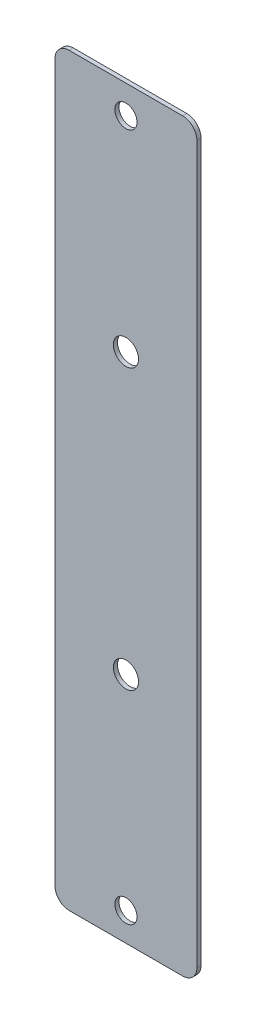
ISO-10303-21;
HEADER;
FILE_DESCRIPTION(('STEP AP214'),'2;1');
FILE_NAME('part.step','',(''),(''),'','','');
FILE_SCHEMA(('AUTOMOTIVE_DESIGN { 1 0 10303 214 1 1 1 1 }'));
ENDSEC;
DATA;
#1=APPLICATION_CONTEXT('core data for automotive mechanical design processes');
#2=APPLICATION_PROTOCOL_DEFINITION('international standard','automotive_design',2000,#1);
#3=PRODUCT_CONTEXT('',#1,'mechanical');
#4=PRODUCT('Part','Part','',(#3));
#5=PRODUCT_RELATED_PRODUCT_CATEGORY('part','',(#4));
#6=PRODUCT_DEFINITION_FORMATION('','',#4);
#7=PRODUCT_DEFINITION_CONTEXT('part definition',#1,'design');
#8=PRODUCT_DEFINITION('design','',#6,#7);
#9=PRODUCT_DEFINITION_SHAPE('','',#8);
#10=(LENGTH_UNIT() NAMED_UNIT(*) SI_UNIT(.MILLI.,.METRE.));
#11=(NAMED_UNIT(*) PLANE_ANGLE_UNIT() SI_UNIT($,.RADIAN.));
#12=(NAMED_UNIT(*) SI_UNIT($,.STERADIAN.) SOLID_ANGLE_UNIT());
#13=UNCERTAINTY_MEASURE_WITH_UNIT(LENGTH_MEASURE(1.E-05),#10,'distance_accuracy_value','');
#14=(GEOMETRIC_REPRESENTATION_CONTEXT(3) GLOBAL_UNCERTAINTY_ASSIGNED_CONTEXT((#13)) GLOBAL_UNIT_ASSIGNED_CONTEXT((#10,
#11,#12)) REPRESENTATION_CONTEXT('',''));
#15=CARTESIAN_POINT('',(0.,0.,0.));
#16=DIRECTION('',(0.,0.,1.));
#17=DIRECTION('',(1.,0.,0.));
#18=AXIS2_PLACEMENT_3D('',#15,#16,#17);
#19=CARTESIAN_POINT('',(0.,0.,-0.7366));
#20=DIRECTION('',(-1.,0.,0.));
#21=DIRECTION('',(0.,0.,1.));
#22=AXIS2_PLACEMENT_3D('',#19,#20,#21);
#23=PLANE('',#22);
#24=DIRECTION('',(0.,-1.,0.));
#25=VECTOR('',#24,1.);
#26=CARTESIAN_POINT('',(0.,0.,-0.7366));
#27=LINE('',#26,#25);
#28=CARTESIAN_POINT('',(0.,130.81,-0.7366));
#29=VERTEX_POINT('',#28);
#30=CARTESIAN_POINT('',(0.,2.54,-0.7366));
#31=VERTEX_POINT('',#30);
#32=EDGE_CURVE('E164',#29,#31,#27,.T.);
#33=ORIENTED_EDGE('',*,*,#32,.T.);
#34=DIRECTION('',(0.,0.,1.));
#35=VECTOR('',#34,1.);
#36=CARTESIAN_POINT('',(0.,2.54,-0.7366));
#37=LINE('',#36,#35);
#38=CARTESIAN_POINT('',(0.,2.54,0.));
#39=VERTEX_POINT('',#38);
#40=EDGE_CURVE('E111',#31,#39,#37,.T.);
#41=ORIENTED_EDGE('',*,*,#40,.T.);
#42=DIRECTION('',(0.,-1.,0.));
#43=VECTOR('',#42,1.);
#44=CARTESIAN_POINT('',(0.,0.,0.));
#45=LINE('',#44,#43);
#46=CARTESIAN_POINT('',(0.,130.81,0.));
#47=VERTEX_POINT('',#46);
#48=EDGE_CURVE('E103',#47,#39,#45,.T.);
#49=ORIENTED_EDGE('',*,*,#48,.F.);
#50=DIRECTION('',(0.,0.,1.));
#51=VECTOR('',#50,1.);
#52=CARTESIAN_POINT('',(0.,130.81,-0.7366));
#53=LINE('',#52,#51);
#54=EDGE_CURVE('E116',#47,#29,#53,.F.);
#55=ORIENTED_EDGE('',*,*,#54,.T.);
#56=EDGE_LOOP('',(#33,#41,#49,#55));
#57=FACE_BOUND('',#56,.T.);
#58=ADVANCED_FACE('F34',(#57),#23,.T.);
#59=CARTESIAN_POINT('',(0.,133.35,-0.7366));
#60=DIRECTION('',(0.,1.,0.));
#61=DIRECTION('',(0.,0.,1.));
#62=AXIS2_PLACEMENT_3D('',#59,#60,#61);
#63=PLANE('',#62);
#64=DIRECTION('',(-1.,0.,0.));
#65=VECTOR('',#64,1.);
#66=CARTESIAN_POINT('',(0.,133.35,0.));
#67=LINE('',#66,#65);
#68=CARTESIAN_POINT('',(22.86,133.35,0.));
#69=VERTEX_POINT('',#68);
#70=CARTESIAN_POINT('',(2.54,133.35,0.));
#71=VERTEX_POINT('',#70);
#72=EDGE_CURVE('E105',#69,#71,#67,.T.);
#73=ORIENTED_EDGE('',*,*,#72,.F.);
#74=DIRECTION('',(0.,0.,1.));
#75=VECTOR('',#74,1.);
#76=CARTESIAN_POINT('',(22.86,133.35,-0.7366));
#77=LINE('',#76,#75);
#78=CARTESIAN_POINT('',(22.86,133.35,-0.7366));
#79=VERTEX_POINT('',#78);
#80=EDGE_CURVE('E11',#69,#79,#77,.F.);
#81=ORIENTED_EDGE('',*,*,#80,.T.);
#82=DIRECTION('',(-1.,0.,0.));
#83=VECTOR('',#82,1.);
#84=CARTESIAN_POINT('',(0.,133.35,-0.7366));
#85=LINE('',#84,#83);
#86=CARTESIAN_POINT('',(2.54,133.35,-0.7366));
#87=VERTEX_POINT('',#86);
#88=EDGE_CURVE('E124',#79,#87,#85,.T.);
#89=ORIENTED_EDGE('',*,*,#88,.T.);
#90=DIRECTION('',(0.,0.,1.));
#91=VECTOR('',#90,1.);
#92=CARTESIAN_POINT('',(2.54,133.35,-0.7366));
#93=LINE('',#92,#91);
#94=EDGE_CURVE('E42',#87,#71,#93,.T.);
#95=ORIENTED_EDGE('',*,*,#94,.T.);
#96=EDGE_LOOP('',(#73,#81,#89,#95));
#97=FACE_BOUND('',#96,.T.);
#98=ADVANCED_FACE('F153',(#97),#63,.T.);
#99=CARTESIAN_POINT('',(25.4,0.,-0.7366));
#100=DIRECTION('',(1.,0.,0.));
#101=DIRECTION('',(0.,1.,0.));
#102=AXIS2_PLACEMENT_3D('',#99,#100,#101);
#103=PLANE('',#102);
#104=DIRECTION('',(0.,1.,0.));
#105=VECTOR('',#104,1.);
#106=CARTESIAN_POINT('',(25.4,0.,0.));
#107=LINE('',#106,#105);
#108=CARTESIAN_POINT('',(25.4,2.54,0.));
#109=VERTEX_POINT('',#108);
#110=CARTESIAN_POINT('',(25.4,130.81,0.));
#111=VERTEX_POINT('',#110);
#112=EDGE_CURVE('E162',#109,#111,#107,.T.);
#113=ORIENTED_EDGE('',*,*,#112,.F.);
#114=DIRECTION('',(0.,0.,1.));
#115=VECTOR('',#114,1.);
#116=CARTESIAN_POINT('',(25.4,2.54,-0.7366));
#117=LINE('',#116,#115);
#118=CARTESIAN_POINT('',(25.4,2.54,-0.7366));
#119=VERTEX_POINT('',#118);
#120=EDGE_CURVE('E56',#109,#119,#117,.F.);
#121=ORIENTED_EDGE('',*,*,#120,.T.);
#122=DIRECTION('',(0.,1.,0.));
#123=VECTOR('',#122,1.);
#124=CARTESIAN_POINT('',(25.4,0.,-0.7366));
#125=LINE('',#124,#123);
#126=CARTESIAN_POINT('',(25.4,130.81,-0.7366));
#127=VERTEX_POINT('',#126);
#128=EDGE_CURVE('E128',#119,#127,#125,.T.);
#129=ORIENTED_EDGE('',*,*,#128,.T.);
#130=DIRECTION('',(0.,0.,1.));
#131=VECTOR('',#130,1.);
#132=CARTESIAN_POINT('',(25.4,130.81,-0.7366));
#133=LINE('',#132,#131);
#134=EDGE_CURVE('E149',#127,#111,#133,.T.);
#135=ORIENTED_EDGE('',*,*,#134,.T.);
#136=EDGE_LOOP('',(#113,#121,#129,#135));
#137=FACE_BOUND('',#136,.T.);
#138=ADVANCED_FACE('F161',(#137),#103,.T.);
#139=CARTESIAN_POINT('',(0.,0.,-0.7366));
#140=DIRECTION('',(0.,-1.,0.));
#141=DIRECTION('',(0.,0.,-1.));
#142=AXIS2_PLACEMENT_3D('',#139,#140,#141);
#143=PLANE('',#142);
#144=DIRECTION('',(1.,0.,0.));
#145=VECTOR('',#144,1.);
#146=CARTESIAN_POINT('',(0.,0.,0.));
#147=LINE('',#146,#145);
#148=CARTESIAN_POINT('',(2.54,0.,0.));
#149=VERTEX_POINT('',#148);
#150=CARTESIAN_POINT('',(22.86,0.,0.));
#151=VERTEX_POINT('',#150);
#152=EDGE_CURVE('E119',#149,#151,#147,.T.);
#153=ORIENTED_EDGE('',*,*,#152,.F.);
#154=DIRECTION('',(0.,0.,1.));
#155=VECTOR('',#154,1.);
#156=CARTESIAN_POINT('',(2.54,0.,-0.7366));
#157=LINE('',#156,#155);
#158=CARTESIAN_POINT('',(2.54,0.,-0.7366));
#159=VERTEX_POINT('',#158);
#160=EDGE_CURVE('E141',#149,#159,#157,.F.);
#161=ORIENTED_EDGE('',*,*,#160,.T.);
#162=DIRECTION('',(1.,0.,0.));
#163=VECTOR('',#162,1.);
#164=CARTESIAN_POINT('',(0.,0.,-0.7366));
#165=LINE('',#164,#163);
#166=CARTESIAN_POINT('',(22.86,0.,-0.7366));
#167=VERTEX_POINT('',#166);
#168=EDGE_CURVE('E168',#159,#167,#165,.T.);
#169=ORIENTED_EDGE('',*,*,#168,.T.);
#170=DIRECTION('',(0.,0.,1.));
#171=VECTOR('',#170,1.);
#172=CARTESIAN_POINT('',(22.86,0.,-0.7366));
#173=LINE('',#172,#171);
#174=EDGE_CURVE('E138',#167,#151,#173,.T.);
#175=ORIENTED_EDGE('',*,*,#174,.T.);
#176=EDGE_LOOP('',(#153,#161,#169,#175));
#177=FACE_BOUND('',#176,.T.);
#178=ADVANCED_FACE('F230',(#177),#143,.T.);
#179=CARTESIAN_POINT('',(0.,0.,-0.7366));
#180=DIRECTION('',(0.,0.,-1.));
#181=DIRECTION('',(-1.,0.,0.));
#182=AXIS2_PLACEMENT_3D('',#179,#180,#181);
#183=PLANE('',#182);
#184=CARTESIAN_POINT('',(12.7,5.08,-0.7366));
#185=DIRECTION('',(0.,0.,1.));
#186=DIRECTION('',(1.,0.,0.));
#187=AXIS2_PLACEMENT_3D('',#184,#185,#186);
#188=CIRCLE('',#187,1.984375);
#189=CARTESIAN_POINT('',(14.684375,5.08,-0.7366));
#190=VERTEX_POINT('',#189);
#191=EDGE_CURVE('E189',#190,#190,#188,.T.);
#192=ORIENTED_EDGE('',*,*,#191,.T.);
#193=EDGE_LOOP('',(#192));
#194=FACE_BOUND('',#193,.T.);
#195=CARTESIAN_POINT('',(12.7,128.27,-0.7366));
#196=DIRECTION('',(0.,0.,1.));
#197=DIRECTION('',(1.,0.,0.));
#198=AXIS2_PLACEMENT_3D('',#195,#196,#197);
#199=CIRCLE('',#198,1.984375);
#200=CARTESIAN_POINT('',(14.684375,128.27,-0.7366));
#201=VERTEX_POINT('',#200);
#202=EDGE_CURVE('E183',#201,#201,#199,.T.);
#203=ORIENTED_EDGE('',*,*,#202,.T.);
#204=EDGE_LOOP('',(#203));
#205=FACE_BOUND('',#204,.T.);
#206=CARTESIAN_POINT('',(12.7,91.675,-0.7366));
#207=DIRECTION('',(0.,0.,1.));
#208=DIRECTION('',(1.,0.,0.));
#209=AXIS2_PLACEMENT_3D('',#206,#207,#208);
#210=CIRCLE('',#209,2.25);
#211=CARTESIAN_POINT('',(14.95,91.675,-0.7366));
#212=VERTEX_POINT('',#211);
#213=EDGE_CURVE('E177',#212,#212,#210,.T.);
#214=ORIENTED_EDGE('',*,*,#213,.T.);
#215=EDGE_LOOP('',(#214));
#216=FACE_BOUND('',#215,.T.);
#217=CARTESIAN_POINT('',(12.7,41.675,-0.7366));
#218=DIRECTION('',(0.,0.,1.));
#219=DIRECTION('',(1.,0.,0.));
#220=AXIS2_PLACEMENT_3D('',#217,#218,#219);
#221=CIRCLE('',#220,2.25);
#222=CARTESIAN_POINT('',(14.95,41.675,-0.7366));
#223=VERTEX_POINT('',#222);
#224=EDGE_CURVE('E120',#223,#223,#221,.T.);
#225=ORIENTED_EDGE('',*,*,#224,.T.);
#226=EDGE_LOOP('',(#225));
#227=FACE_BOUND('',#226,.T.);
#228=ORIENTED_EDGE('',*,*,#168,.F.);
#229=CARTESIAN_POINT('',(2.54,2.54,-0.7366));
#230=DIRECTION('',(0.,0.,-1.));
#231=DIRECTION('',(-1.,0.,0.));
#232=AXIS2_PLACEMENT_3D('',#229,#230,#231);
#233=CIRCLE('',#232,2.54);
#234=EDGE_CURVE('E147',#159,#31,#233,.T.);
#235=ORIENTED_EDGE('',*,*,#234,.T.);
#236=ORIENTED_EDGE('',*,*,#32,.F.);
#237=CARTESIAN_POINT('',(2.54,130.81,-0.7366));
#238=DIRECTION('',(0.,0.,-1.));
#239=DIRECTION('',(-1.,0.,0.));
#240=AXIS2_PLACEMENT_3D('',#237,#238,#239);
#241=CIRCLE('',#240,2.54);
#242=EDGE_CURVE('E123',#29,#87,#241,.T.);
#243=ORIENTED_EDGE('',*,*,#242,.T.);
#244=ORIENTED_EDGE('',*,*,#88,.F.);
#245=CARTESIAN_POINT('',(22.86,130.81,-0.7366));
#246=DIRECTION('',(0.,0.,-1.));
#247=DIRECTION('',(-1.,0.,0.));
#248=AXIS2_PLACEMENT_3D('',#245,#246,#247);
#249=CIRCLE('',#248,2.54);
#250=EDGE_CURVE('E49',#79,#127,#249,.T.);
#251=ORIENTED_EDGE('',*,*,#250,.T.);
#252=ORIENTED_EDGE('',*,*,#128,.F.);
#253=CARTESIAN_POINT('',(22.86,2.54,-0.7366));
#254=DIRECTION('',(0.,0.,-1.));
#255=DIRECTION('',(-1.,0.,0.));
#256=AXIS2_PLACEMENT_3D('',#253,#254,#255);
#257=CIRCLE('',#256,2.54);
#258=EDGE_CURVE('E145',#119,#167,#257,.T.);
#259=ORIENTED_EDGE('',*,*,#258,.T.);
#260=EDGE_LOOP('',(#228,#235,#236,#243,#244,#251,#252,#259));
#261=FACE_BOUND('',#260,.T.);
#262=ADVANCED_FACE('F156',(#194,#205,#216,#227,#261),#183,.T.);
#263=CARTESIAN_POINT('',(0.,0.,0.));
#264=DIRECTION('',(0.,0.,-1.));
#265=DIRECTION('',(-1.,0.,0.));
#266=AXIS2_PLACEMENT_3D('',#263,#264,#265);
#267=PLANE('',#266);
#268=CARTESIAN_POINT('',(12.7,5.08,0.));
#269=DIRECTION('',(0.,0.,1.));
#270=DIRECTION('',(1.,0.,0.));
#271=AXIS2_PLACEMENT_3D('',#268,#269,#270);
#272=CIRCLE('',#271,1.984375);
#273=CARTESIAN_POINT('',(14.684375,5.08,0.));
#274=VERTEX_POINT('',#273);
#275=EDGE_CURVE('E192',#274,#274,#272,.T.);
#276=ORIENTED_EDGE('',*,*,#275,.F.);
#277=EDGE_LOOP('',(#276));
#278=FACE_BOUND('',#277,.T.);
#279=CARTESIAN_POINT('',(12.7,128.27,0.));
#280=DIRECTION('',(0.,0.,1.));
#281=DIRECTION('',(1.,0.,0.));
#282=AXIS2_PLACEMENT_3D('',#279,#280,#281);
#283=CIRCLE('',#282,1.984375);
#284=CARTESIAN_POINT('',(14.684375,128.27,0.));
#285=VERTEX_POINT('',#284);
#286=EDGE_CURVE('E186',#285,#285,#283,.T.);
#287=ORIENTED_EDGE('',*,*,#286,.F.);
#288=EDGE_LOOP('',(#287));
#289=FACE_BOUND('',#288,.T.);
#290=CARTESIAN_POINT('',(12.7,91.675,0.));
#291=DIRECTION('',(0.,0.,1.));
#292=DIRECTION('',(1.,0.,0.));
#293=AXIS2_PLACEMENT_3D('',#290,#291,#292);
#294=CIRCLE('',#293,2.25);
#295=CARTESIAN_POINT('',(14.95,91.675,0.));
#296=VERTEX_POINT('',#295);
#297=EDGE_CURVE('E180',#296,#296,#294,.T.);
#298=ORIENTED_EDGE('',*,*,#297,.F.);
#299=EDGE_LOOP('',(#298));
#300=FACE_BOUND('',#299,.T.);
#301=CARTESIAN_POINT('',(12.7,41.675,0.));
#302=DIRECTION('',(0.,0.,1.));
#303=DIRECTION('',(1.,0.,0.));
#304=AXIS2_PLACEMENT_3D('',#301,#302,#303);
#305=CIRCLE('',#304,2.25);
#306=CARTESIAN_POINT('',(14.95,41.675,0.));
#307=VERTEX_POINT('',#306);
#308=EDGE_CURVE('E174',#307,#307,#305,.T.);
#309=ORIENTED_EDGE('',*,*,#308,.F.);
#310=EDGE_LOOP('',(#309));
#311=FACE_BOUND('',#310,.T.);
#312=ORIENTED_EDGE('',*,*,#48,.T.);
#313=CARTESIAN_POINT('',(2.54,2.54,0.));
#314=DIRECTION('',(0.,0.,-1.));
#315=DIRECTION('',(-1.,0.,0.));
#316=AXIS2_PLACEMENT_3D('',#313,#314,#315);
#317=CIRCLE('',#316,2.54);
#318=EDGE_CURVE('E136',#39,#149,#317,.F.);
#319=ORIENTED_EDGE('',*,*,#318,.T.);
#320=ORIENTED_EDGE('',*,*,#152,.T.);
#321=CARTESIAN_POINT('',(22.86,2.54,0.));
#322=DIRECTION('',(0.,0.,-1.));
#323=DIRECTION('',(-1.,0.,0.));
#324=AXIS2_PLACEMENT_3D('',#321,#322,#323);
#325=CIRCLE('',#324,2.54);
#326=EDGE_CURVE('E134',#151,#109,#325,.F.);
#327=ORIENTED_EDGE('',*,*,#326,.T.);
#328=ORIENTED_EDGE('',*,*,#112,.T.);
#329=CARTESIAN_POINT('',(22.86,130.81,0.));
#330=DIRECTION('',(0.,0.,-1.));
#331=DIRECTION('',(-1.,0.,0.));
#332=AXIS2_PLACEMENT_3D('',#329,#330,#331);
#333=CIRCLE('',#332,2.54);
#334=EDGE_CURVE('E110',#111,#69,#333,.F.);
#335=ORIENTED_EDGE('',*,*,#334,.T.);
#336=ORIENTED_EDGE('',*,*,#72,.T.);
#337=CARTESIAN_POINT('',(2.54,130.81,0.));
#338=DIRECTION('',(0.,0.,-1.));
#339=DIRECTION('',(-1.,0.,0.));
#340=AXIS2_PLACEMENT_3D('',#337,#338,#339);
#341=CIRCLE('',#340,2.54);
#342=EDGE_CURVE('E100',#71,#47,#341,.F.);
#343=ORIENTED_EDGE('',*,*,#342,.T.);
#344=EDGE_LOOP('',(#312,#319,#320,#327,#328,#335,#336,#343));
#345=FACE_BOUND('',#344,.T.);
#346=ADVANCED_FACE('F102',(#278,#289,#300,#311,#345),#267,.F.);
#347=CARTESIAN_POINT('',(2.54,2.54,-0.7366));
#348=DIRECTION('',(0.,0.,1.));
#349=DIRECTION('',(1.,0.,0.));
#350=AXIS2_PLACEMENT_3D('',#347,#348,#349);
#351=CYLINDRICAL_SURFACE('',#350,2.54);
#352=ORIENTED_EDGE('',*,*,#234,.F.);
#353=ORIENTED_EDGE('',*,*,#160,.F.);
#354=ORIENTED_EDGE('',*,*,#318,.F.);
#355=ORIENTED_EDGE('',*,*,#40,.F.);
#356=EDGE_LOOP('',(#352,#353,#354,#355));
#357=FACE_BOUND('',#356,.T.);
#358=ADVANCED_FACE('F200',(#357),#351,.T.);
#359=CARTESIAN_POINT('',(22.86,2.54,-0.7366));
#360=DIRECTION('',(0.,0.,1.));
#361=DIRECTION('',(1.,0.,0.));
#362=AXIS2_PLACEMENT_3D('',#359,#360,#361);
#363=CYLINDRICAL_SURFACE('',#362,2.54);
#364=ORIENTED_EDGE('',*,*,#258,.F.);
#365=ORIENTED_EDGE('',*,*,#120,.F.);
#366=ORIENTED_EDGE('',*,*,#326,.F.);
#367=ORIENTED_EDGE('',*,*,#174,.F.);
#368=EDGE_LOOP('',(#364,#365,#366,#367));
#369=FACE_BOUND('',#368,.T.);
#370=ADVANCED_FACE('F234',(#369),#363,.T.);
#371=CARTESIAN_POINT('',(22.86,130.81,-0.7366));
#372=DIRECTION('',(0.,0.,1.));
#373=DIRECTION('',(1.,0.,0.));
#374=AXIS2_PLACEMENT_3D('',#371,#372,#373);
#375=CYLINDRICAL_SURFACE('',#374,2.54);
#376=ORIENTED_EDGE('',*,*,#250,.F.);
#377=ORIENTED_EDGE('',*,*,#80,.F.);
#378=ORIENTED_EDGE('',*,*,#334,.F.);
#379=ORIENTED_EDGE('',*,*,#134,.F.);
#380=EDGE_LOOP('',(#376,#377,#378,#379));
#381=FACE_BOUND('',#380,.T.);
#382=ADVANCED_FACE('F159',(#381),#375,.T.);
#383=CARTESIAN_POINT('',(2.54,130.81,-0.7366));
#384=DIRECTION('',(0.,0.,1.));
#385=DIRECTION('',(1.,0.,0.));
#386=AXIS2_PLACEMENT_3D('',#383,#384,#385);
#387=CYLINDRICAL_SURFACE('',#386,2.54);
#388=ORIENTED_EDGE('',*,*,#242,.F.);
#389=ORIENTED_EDGE('',*,*,#54,.F.);
#390=ORIENTED_EDGE('',*,*,#342,.F.);
#391=ORIENTED_EDGE('',*,*,#94,.F.);
#392=EDGE_LOOP('',(#388,#389,#390,#391));
#393=FACE_BOUND('',#392,.T.);
#394=ADVANCED_FACE('F36',(#393),#387,.T.);
#395=CARTESIAN_POINT('',(12.7,41.675,0.));
#396=DIRECTION('',(0.,0.,1.));
#397=DIRECTION('',(1.,0.,0.));
#398=AXIS2_PLACEMENT_3D('',#395,#396,#397);
#399=CYLINDRICAL_SURFACE('',#398,2.25);
#400=ORIENTED_EDGE('',*,*,#224,.F.);
#401=EDGE_LOOP('',(#400));
#402=FACE_BOUND('',#401,.T.);
#403=ORIENTED_EDGE('',*,*,#308,.T.);
#404=EDGE_LOOP('',(#403));
#405=FACE_BOUND('',#404,.T.);
#406=ADVANCED_FACE('F208',(#402,#405),#399,.F.);
#407=CARTESIAN_POINT('',(12.7,91.675,0.));
#408=DIRECTION('',(0.,0.,1.));
#409=DIRECTION('',(1.,0.,0.));
#410=AXIS2_PLACEMENT_3D('',#407,#408,#409);
#411=CYLINDRICAL_SURFACE('',#410,2.25);
#412=ORIENTED_EDGE('',*,*,#213,.F.);
#413=EDGE_LOOP('',(#412));
#414=FACE_BOUND('',#413,.T.);
#415=ORIENTED_EDGE('',*,*,#297,.T.);
#416=EDGE_LOOP('',(#415));
#417=FACE_BOUND('',#416,.T.);
#418=ADVANCED_FACE('F210',(#414,#417),#411,.F.);
#419=CARTESIAN_POINT('',(12.7,128.27,0.));
#420=DIRECTION('',(0.,0.,1.));
#421=DIRECTION('',(1.,0.,0.));
#422=AXIS2_PLACEMENT_3D('',#419,#420,#421);
#423=CYLINDRICAL_SURFACE('',#422,1.984375);
#424=ORIENTED_EDGE('',*,*,#202,.F.);
#425=EDGE_LOOP('',(#424));
#426=FACE_BOUND('',#425,.T.);
#427=ORIENTED_EDGE('',*,*,#286,.T.);
#428=EDGE_LOOP('',(#427));
#429=FACE_BOUND('',#428,.T.);
#430=ADVANCED_FACE('F217',(#426,#429),#423,.F.);
#431=CARTESIAN_POINT('',(12.7,5.08,0.));
#432=DIRECTION('',(0.,0.,1.));
#433=DIRECTION('',(1.,0.,0.));
#434=AXIS2_PLACEMENT_3D('',#431,#432,#433);
#435=CYLINDRICAL_SURFACE('',#434,1.984375);
#436=ORIENTED_EDGE('',*,*,#191,.F.);
#437=EDGE_LOOP('',(#436));
#438=FACE_BOUND('',#437,.T.);
#439=ORIENTED_EDGE('',*,*,#275,.T.);
#440=EDGE_LOOP('',(#439));
#441=FACE_BOUND('',#440,.T.);
#442=ADVANCED_FACE('F196',(#438,#441),#435,.F.);
#443=CLOSED_SHELL('',(#58,#98,#138,#178,#262,#346,#358,#370,#382,#394,#406,#418,#430,#442));
#444=MANIFOLD_SOLID_BREP('B2',#443);
#445=ADVANCED_BREP_SHAPE_REPRESENTATION('',(#18,#444),#14);
#446=SHAPE_DEFINITION_REPRESENTATION(#9,#445);
ENDSEC;
END-ISO-10303-21;
